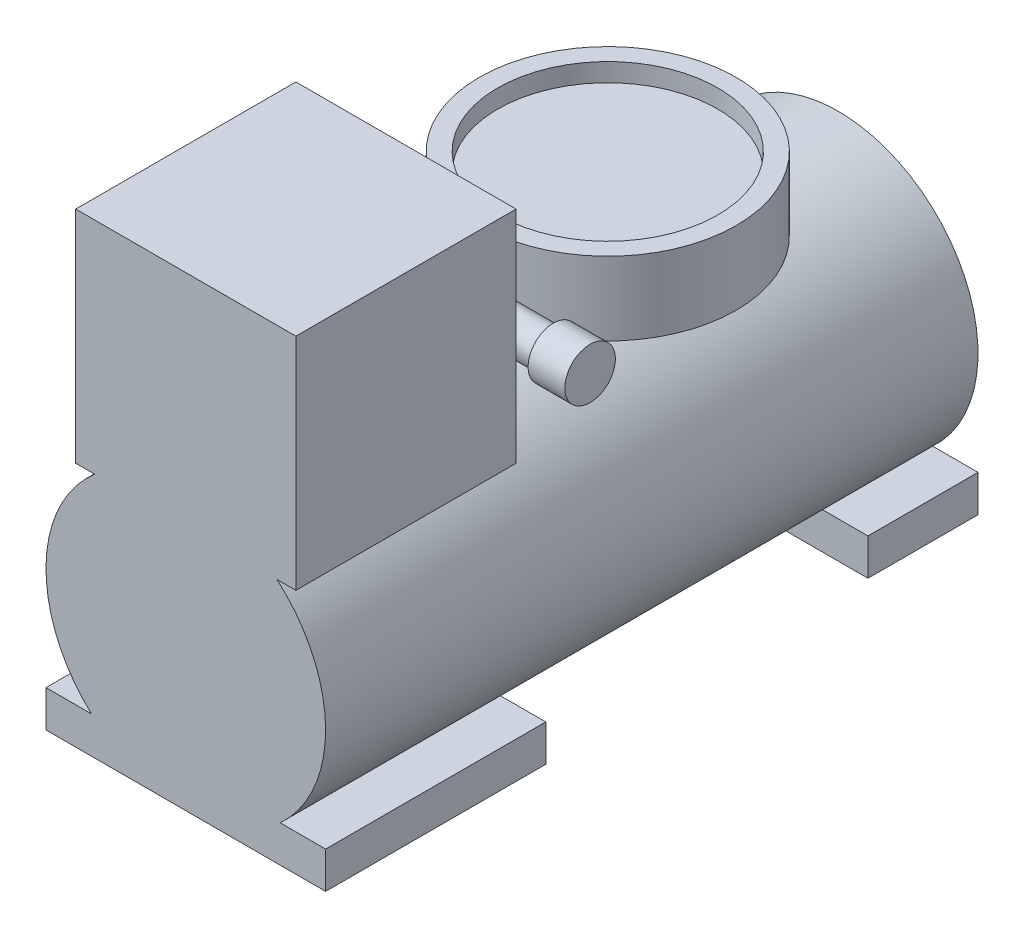
ISO-10303-21;
HEADER;
FILE_DESCRIPTION(('STEP AP214'),'2;1');
FILE_NAME('part.step','',(''),(''),'','','');
FILE_SCHEMA(('AUTOMOTIVE_DESIGN { 1 0 10303 214 1 1 1 1 }'));
ENDSEC;
DATA;
#1=APPLICATION_CONTEXT('core data for automotive mechanical design processes');
#2=APPLICATION_PROTOCOL_DEFINITION('international standard','automotive_design',2000,#1);
#3=PRODUCT_CONTEXT('',#1,'mechanical');
#4=PRODUCT('Part','Part','',(#3));
#5=PRODUCT_RELATED_PRODUCT_CATEGORY('part','',(#4));
#6=PRODUCT_DEFINITION_FORMATION('','',#4);
#7=PRODUCT_DEFINITION_CONTEXT('part definition',#1,'design');
#8=PRODUCT_DEFINITION('design','',#6,#7);
#9=PRODUCT_DEFINITION_SHAPE('','',#8);
#10=(LENGTH_UNIT() NAMED_UNIT(*) SI_UNIT(.MILLI.,.METRE.));
#11=(NAMED_UNIT(*) PLANE_ANGLE_UNIT() SI_UNIT($,.RADIAN.));
#12=(NAMED_UNIT(*) SI_UNIT($,.STERADIAN.) SOLID_ANGLE_UNIT());
#13=UNCERTAINTY_MEASURE_WITH_UNIT(LENGTH_MEASURE(1.E-05),#10,'distance_accuracy_value','');
#14=(GEOMETRIC_REPRESENTATION_CONTEXT(3) GLOBAL_UNCERTAINTY_ASSIGNED_CONTEXT((#13)) GLOBAL_UNIT_ASSIGNED_CONTEXT((#10,
#11,#12)) REPRESENTATION_CONTEXT('',''));
#15=CARTESIAN_POINT('',(0.,0.,0.));
#16=DIRECTION('',(0.,0.,1.));
#17=DIRECTION('',(1.,0.,0.));
#18=AXIS2_PLACEMENT_3D('',#15,#16,#17);
#19=CARTESIAN_POINT('',(40.,50.,107.620508075689));
#20=DIRECTION('',(-1.,0.,0.));
#21=DIRECTION('',(0.,0.,1.));
#22=AXIS2_PLACEMENT_3D('',#19,#20,#21);
#23=CYLINDRICAL_SURFACE('',#22,5.);
#24=CARTESIAN_POINT('',(0.,50.,107.620508075689));
#25=DIRECTION('',(0.707106781186547,0.,0.707106781186547));
#26=DIRECTION('',(-0.707106781186547,0.,0.707106781186547));
#27=AXIS2_PLACEMENT_3D('',#24,#25,#26);
#28=ELLIPSE('',#27,7.07106781186548,5.);
#29=CARTESIAN_POINT('',(0.,45.,107.620508075689));
#30=VERTEX_POINT('',#29);
#31=CARTESIAN_POINT('',(0.,55.,107.620508075689));
#32=VERTEX_POINT('',#31);
#33=EDGE_CURVE('E88',#30,#32,#28,.T.);
#34=ORIENTED_EDGE('',*,*,#33,.T.);
#35=CARTESIAN_POINT('',(0.,50.,107.620508075689));
#36=DIRECTION('',(-0.707106781186547,0.,0.707106781186547));
#37=DIRECTION('',(0.707106781186547,0.,0.707106781186547));
#38=AXIS2_PLACEMENT_3D('',#35,#36,#37);
#39=ELLIPSE('',#38,7.07106781186548,5.);
#40=EDGE_CURVE('E82',#32,#30,#39,.F.);
#41=ORIENTED_EDGE('',*,*,#40,.T.);
#42=EDGE_LOOP('',(#34,#41));
#43=FACE_BOUND('',#42,.T.);
#44=CARTESIAN_POINT('',(30.,50.,107.620508075689));
#45=DIRECTION('',(1.,0.,0.));
#46=DIRECTION('',(0.,0.,-1.));
#47=AXIS2_PLACEMENT_3D('',#44,#45,#46);
#48=CIRCLE('',#47,5.);
#49=CARTESIAN_POINT('',(30.,50.,102.620508075689));
#50=VERTEX_POINT('',#49);
#51=EDGE_CURVE('E14',#50,#50,#48,.T.);
#52=ORIENTED_EDGE('',*,*,#51,.F.);
#53=EDGE_LOOP('',(#52));
#54=FACE_BOUND('',#53,.T.);
#55=ADVANCED_FACE('F73',(#43,#54),#23,.T.);
#56=CARTESIAN_POINT('',(0.,50.,97.8));
#57=DIRECTION('',(0.,0.,1.));
#58=DIRECTION('',(1.,0.,0.));
#59=AXIS2_PLACEMENT_3D('',#56,#57,#58);
#60=CYLINDRICAL_SURFACE('',#59,5.);
#61=CARTESIAN_POINT('',(0.,50.,117.8));
#62=DIRECTION('',(0.,0.,-1.));
#63=DIRECTION('',(-1.,0.,0.));
#64=AXIS2_PLACEMENT_3D('',#61,#62,#63);
#65=CIRCLE('',#64,5.);
#66=CARTESIAN_POINT('',(-5.,50.,117.8));
#67=VERTEX_POINT('',#66);
#68=EDGE_CURVE('E365',#67,#67,#65,.T.);
#69=ORIENTED_EDGE('',*,*,#68,.T.);
#70=EDGE_LOOP('',(#69));
#71=FACE_BOUND('',#70,.T.);
#72=CARTESIAN_POINT('',(0.,50.,97.8));
#73=DIRECTION('',(0.,0.,-1.));
#74=DIRECTION('',(-1.,0.,0.));
#75=AXIS2_PLACEMENT_3D('',#72,#73,#74);
#76=CIRCLE('',#75,5.);
#77=CARTESIAN_POINT('',(-5.,50.,97.8));
#78=VERTEX_POINT('',#77);
#79=CARTESIAN_POINT('',(5.00000000000003,50.,97.8));
#80=VERTEX_POINT('',#79);
#81=EDGE_CURVE('E352',#78,#80,#76,.T.);
#82=ORIENTED_EDGE('',*,*,#81,.F.);
#83=EDGE_CURVE('E368',#80,#78,#76,.T.);
#84=ORIENTED_EDGE('',*,*,#83,.F.);
#85=EDGE_LOOP('',(#82,#84));
#86=FACE_BOUND('',#85,.T.);
#87=ORIENTED_EDGE('',*,*,#40,.F.);
#88=ORIENTED_EDGE('',*,*,#33,.F.);
#89=EDGE_LOOP('',(#87,#88));
#90=FACE_BOUND('',#89,.T.);
#91=ADVANCED_FACE('F252',(#71,#86,#90),#60,.T.);
#92=CARTESIAN_POINT('',(0.,0.,177.8));
#93=DIRECTION('',(0.,0.,-1.));
#94=DIRECTION('',(-1.,0.,0.));
#95=AXIS2_PLACEMENT_3D('',#92,#93,#94);
#96=CYLINDRICAL_SURFACE('',#95,38.1);
#97=CARTESIAN_POINT('',(0.,0.,0.));
#98=DIRECTION('',(0.,0.,1.));
#99=DIRECTION('',(1.,0.,0.));
#100=AXIS2_PLACEMENT_3D('',#97,#98,#99);
#101=CIRCLE('',#100,38.1);
#102=CARTESIAN_POINT('',(25.7293606605372,-28.1,0.));
#103=VERTEX_POINT('',#102);
#104=CARTESIAN_POINT('',(-25.7293606605372,-28.1,0.));
#105=VERTEX_POINT('',#104);
#106=EDGE_CURVE('E277',#103,#105,#101,.T.);
#107=ORIENTED_EDGE('',*,*,#106,.T.);
#108=DIRECTION('',(0.,0.,-1.));
#109=VECTOR('',#108,1.);
#110=CARTESIAN_POINT('',(-25.7293606605372,-28.1,30.));
#111=LINE('',#110,#109);
#112=CARTESIAN_POINT('',(-25.7293606605372,-28.1,30.));
#113=VERTEX_POINT('',#112);
#114=EDGE_CURVE('E890',#113,#105,#111,.T.);
#115=ORIENTED_EDGE('',*,*,#114,.F.);
#116=CARTESIAN_POINT('',(0.,0.,30.));
#117=DIRECTION('',(0.,0.,-1.));
#118=DIRECTION('',(-1.,0.,0.));
#119=AXIS2_PLACEMENT_3D('',#116,#117,#118);
#120=CIRCLE('',#119,38.1);
#121=CARTESIAN_POINT('',(0.,-38.1,30.));
#122=VERTEX_POINT('',#121);
#123=EDGE_CURVE('E888',#122,#113,#120,.T.);
#124=ORIENTED_EDGE('',*,*,#123,.F.);
#125=CARTESIAN_POINT('',(0.,0.,30.));
#126=DIRECTION('',(0.,0.,-1.));
#127=DIRECTION('',(-1.,0.,0.));
#128=AXIS2_PLACEMENT_3D('',#125,#126,#127);
#129=CIRCLE('',#128,38.1);
#130=CARTESIAN_POINT('',(25.7293606605372,-28.1,30.));
#131=VERTEX_POINT('',#130);
#132=EDGE_CURVE('E96',#131,#122,#129,.T.);
#133=ORIENTED_EDGE('',*,*,#132,.F.);
#134=DIRECTION('',(0.,0.,-1.));
#135=VECTOR('',#134,1.);
#136=CARTESIAN_POINT('',(25.7293606605372,-28.1,30.));
#137=LINE('',#136,#135);
#138=EDGE_CURVE('E924',#131,#103,#137,.T.);
#139=ORIENTED_EDGE('',*,*,#138,.T.);
#140=EDGE_LOOP('',(#107,#115,#124,#133,#139));
#141=FACE_BOUND('',#140,.T.);
#142=CARTESIAN_POINT('',(0.,0.,177.8));
#143=DIRECTION('',(0.,0.,1.));
#144=DIRECTION('',(1.,0.,0.));
#145=AXIS2_PLACEMENT_3D('',#142,#143,#144);
#146=CIRCLE('',#145,38.1);
#147=CARTESIAN_POINT('',(25.7293606605372,-28.1,177.8));
#148=VERTEX_POINT('',#147);
#149=CARTESIAN_POINT('',(24.8274042138924,28.9,177.8));
#150=VERTEX_POINT('',#149);
#151=EDGE_CURVE('E280',#148,#150,#146,.T.);
#152=ORIENTED_EDGE('',*,*,#151,.F.);
#153=DIRECTION('',(0.,0.,-1.));
#154=VECTOR('',#153,1.);
#155=CARTESIAN_POINT('',(25.7293606605372,-28.1,177.8));
#156=LINE('',#155,#154);
#157=CARTESIAN_POINT('',(25.7293606605372,-28.1,117.8));
#158=VERTEX_POINT('',#157);
#159=EDGE_CURVE('E312',#148,#158,#156,.T.);
#160=ORIENTED_EDGE('',*,*,#159,.T.);
#161=CARTESIAN_POINT('',(0.,0.,117.8));
#162=DIRECTION('',(0.,0.,1.));
#163=DIRECTION('',(1.,0.,0.));
#164=AXIS2_PLACEMENT_3D('',#161,#162,#163);
#165=CIRCLE('',#164,38.1);
#166=CARTESIAN_POINT('',(0.,-38.1,117.8));
#167=VERTEX_POINT('',#166);
#168=EDGE_CURVE('E271',#167,#158,#165,.T.);
#169=ORIENTED_EDGE('',*,*,#168,.F.);
#170=CARTESIAN_POINT('',(-25.7293606605372,-28.1,117.8));
#171=VERTEX_POINT('',#170);
#172=EDGE_CURVE('E270',#171,#167,#165,.T.);
#173=ORIENTED_EDGE('',*,*,#172,.F.);
#174=DIRECTION('',(0.,0.,-1.));
#175=VECTOR('',#174,1.);
#176=CARTESIAN_POINT('',(-25.7293606605372,-28.1,177.8));
#177=LINE('',#176,#175);
#178=CARTESIAN_POINT('',(-25.7293606605372,-28.1,177.8));
#179=VERTEX_POINT('',#178);
#180=EDGE_CURVE('E326',#171,#179,#177,.F.);
#181=ORIENTED_EDGE('',*,*,#180,.T.);
#182=CARTESIAN_POINT('',(-24.8274042138924,28.9,177.8));
#183=VERTEX_POINT('',#182);
#184=EDGE_CURVE('E276',#183,#179,#146,.T.);
#185=ORIENTED_EDGE('',*,*,#184,.F.);
#186=DIRECTION('',(0.,0.,-1.));
#187=VECTOR('',#186,1.);
#188=CARTESIAN_POINT('',(-24.8274042138924,28.9,177.8));
#189=LINE('',#188,#187);
#190=CARTESIAN_POINT('',(-24.8274042138924,28.9,117.8));
#191=VERTEX_POINT('',#190);
#192=EDGE_CURVE('E281',#183,#191,#189,.T.);
#193=ORIENTED_EDGE('',*,*,#192,.T.);
#194=CARTESIAN_POINT('',(0.,0.,117.8));
#195=DIRECTION('',(0.,0.,-1.));
#196=DIRECTION('',(-1.,0.,0.));
#197=AXIS2_PLACEMENT_3D('',#194,#195,#196);
#198=CIRCLE('',#197,38.1);
#199=CARTESIAN_POINT('',(24.8274042138924,28.9,117.8));
#200=VERTEX_POINT('',#199);
#201=EDGE_CURVE('E273',#191,#200,#198,.T.);
#202=ORIENTED_EDGE('',*,*,#201,.T.);
#203=DIRECTION('',(0.,0.,-1.));
#204=VECTOR('',#203,1.);
#205=CARTESIAN_POINT('',(24.8274042138924,28.9,177.8));
#206=LINE('',#205,#204);
#207=EDGE_CURVE('E286',#200,#150,#206,.F.);
#208=ORIENTED_EDGE('',*,*,#207,.T.);
#209=EDGE_LOOP('',(#152,#160,#169,#173,#181,#185,#193,#202,#208));
#210=FACE_BOUND('',#209,.T.);
#211=DIRECTION('',(0.,0.,-1.));
#212=VECTOR('',#211,1.);
#213=CARTESIAN_POINT('',(2.75862284482696,38.,177.8));
#214=LINE('',#213,#212);
#215=CARTESIAN_POINT('',(2.75862284482696,38.,27.9088836521386));
#216=VERTEX_POINT('',#215);
#217=CARTESIAN_POINT('',(2.75862284482696,38.,19.4226500356341));
#218=VERTEX_POINT('',#217);
#219=EDGE_CURVE('E255',#216,#218,#214,.T.);
#220=ORIENTED_EDGE('',*,*,#219,.F.);
#221=CARTESIAN_POINT('',(2.75862284482696,38.,27.9088836521386));
#222=CARTESIAN_POINT('',(2.29995406358398,38.0333182537512,27.8725988734871));
#223=CARTESIAN_POINT('',(1.8399637283857,38.0583421739678,27.8453519247581));
#224=CARTESIAN_POINT('',(0.919979751665722,38.091659244289,27.8090784101043));
#225=CARTESIAN_POINT('',(0.459989875832862,38.1,27.8));
#226=CARTESIAN_POINT('',(-0.45998987583286,38.1,27.8));
#227=CARTESIAN_POINT('',(-0.91997975166572,38.091659244289,27.8090784101043));
#228=CARTESIAN_POINT('',(-1.8399637283857,38.0583421739678,27.8453519247581));
#229=CARTESIAN_POINT('',(-2.29995406358398,38.0333182537512,27.8725988734871));
#230=CARTESIAN_POINT('',(-2.75862284482696,38.,27.9088836521386));
#231=B_SPLINE_CURVE_WITH_KNOTS('',3,(#221,#222,#223,#224,#225,#226,#227,#228,#229,#230),
.UNSPECIFIED.,.F.,.F.,(4,2,2,2,4),(0.,1.38376181539044,2.76356938468601,4.14337695398159,
5.52713876937202),.UNSPECIFIED.);
#232=CARTESIAN_POINT('',(-2.75862284482696,38.,27.9088836521386));
#233=VERTEX_POINT('',#232);
#234=EDGE_CURVE('E377',#216,#233,#231,.T.);
#235=ORIENTED_EDGE('',*,*,#234,.T.);
#236=DIRECTION('',(0.,0.,-1.));
#237=VECTOR('',#236,1.);
#238=CARTESIAN_POINT('',(-2.75862284482696,38.,177.8));
#239=LINE('',#238,#237);
#240=CARTESIAN_POINT('',(-2.75862284482696,38.,19.4226500356341));
#241=VERTEX_POINT('',#240);
#242=EDGE_CURVE('E262',#241,#233,#239,.F.);
#243=ORIENTED_EDGE('',*,*,#242,.F.);
#244=CARTESIAN_POINT('',(0.,0.,19.4226500356341));
#245=DIRECTION('',(0.,0.,-1.));
#246=DIRECTION('',(-1.,0.,0.));
#247=AXIS2_PLACEMENT_3D('',#244,#245,#246);
#248=CIRCLE('',#247,38.1);
#249=EDGE_CURVE('E257',#241,#218,#248,.T.);
#250=ORIENTED_EDGE('',*,*,#249,.T.);
#251=EDGE_LOOP('',(#220,#235,#243,#250));
#252=FACE_BOUND('',#251,.T.);
#253=ADVANCED_FACE('F75',(#141,#210,#252),#96,.T.);
#254=CARTESIAN_POINT('',(0.,0.,97.8));
#255=DIRECTION('',(0.,0.,1.));
#256=DIRECTION('',(1.,0.,0.));
#257=AXIS2_PLACEMENT_3D('',#254,#255,#256);
#258=PLANE('',#257);
#259=DIRECTION('',(0.,-1.,0.));
#260=VECTOR('',#259,1.);
#261=CARTESIAN_POINT('',(5.00000000000003,0.,97.8));
#262=LINE('',#261,#260);
#263=CARTESIAN_POINT('',(5.00000000000003,60.,97.8));
#264=VERTEX_POINT('',#263);
#265=EDGE_CURVE('E264',#264,#80,#262,.T.);
#266=ORIENTED_EDGE('',*,*,#265,.F.);
#267=DIRECTION('',(1.,0.,0.));
#268=VECTOR('',#267,1.);
#269=CARTESIAN_POINT('',(35.,60.,97.8));
#270=LINE('',#269,#268);
#271=CARTESIAN_POINT('',(-5.,60.,97.8));
#272=VERTEX_POINT('',#271);
#273=EDGE_CURVE('E374',#272,#264,#270,.T.);
#274=ORIENTED_EDGE('',*,*,#273,.F.);
#275=DIRECTION('',(0.,1.,0.));
#276=VECTOR('',#275,1.);
#277=CARTESIAN_POINT('',(-5.,0.,97.8));
#278=LINE('',#277,#276);
#279=EDGE_CURVE('E268',#78,#272,#278,.T.);
#280=ORIENTED_EDGE('',*,*,#279,.F.);
#281=ORIENTED_EDGE('',*,*,#81,.T.);
#282=EDGE_LOOP('',(#266,#274,#280,#281));
#283=FACE_BOUND('',#282,.T.);
#284=ADVANCED_FACE('F406',(#283),#258,.T.);
#285=CARTESIAN_POINT('',(0.,0.,177.8));
#286=DIRECTION('',(0.,0.,1.));
#287=DIRECTION('',(1.,0.,0.));
#288=AXIS2_PLACEMENT_3D('',#285,#286,#287);
#289=PLANE('',#288);
#290=ORIENTED_EDGE('',*,*,#184,.T.);
#291=DIRECTION('',(-1.,0.,0.));
#292=VECTOR('',#291,1.);
#293=CARTESIAN_POINT('',(-38.1,-28.1,177.8));
#294=LINE('',#293,#292);
#295=CARTESIAN_POINT('',(-38.1,-28.1,177.8));
#296=VERTEX_POINT('',#295);
#297=EDGE_CURVE('E343',#179,#296,#294,.T.);
#298=ORIENTED_EDGE('',*,*,#297,.T.);
#299=DIRECTION('',(0.,-1.,0.));
#300=VECTOR('',#299,1.);
#301=CARTESIAN_POINT('',(-38.1,-28.1,177.8));
#302=LINE('',#301,#300);
#303=CARTESIAN_POINT('',(-38.1,-38.1,177.8));
#304=VERTEX_POINT('',#303);
#305=EDGE_CURVE('E349',#296,#304,#302,.T.);
#306=ORIENTED_EDGE('',*,*,#305,.T.);
#307=DIRECTION('',(1.,0.,0.));
#308=VECTOR('',#307,1.);
#309=CARTESIAN_POINT('',(-38.1,-38.1,177.8));
#310=LINE('',#309,#308);
#311=CARTESIAN_POINT('',(38.1,-38.1,177.8));
#312=VERTEX_POINT('',#311);
#313=EDGE_CURVE('E347',#304,#312,#310,.T.);
#314=ORIENTED_EDGE('',*,*,#313,.T.);
#315=DIRECTION('',(0.,1.,0.));
#316=VECTOR('',#315,1.);
#317=CARTESIAN_POINT('',(38.1,-28.1,177.8));
#318=LINE('',#317,#316);
#319=CARTESIAN_POINT('',(38.1,-28.1,177.8));
#320=VERTEX_POINT('',#319);
#321=EDGE_CURVE('E344',#312,#320,#318,.T.);
#322=ORIENTED_EDGE('',*,*,#321,.T.);
#323=EDGE_CURVE('E340',#320,#148,#294,.T.);
#324=ORIENTED_EDGE('',*,*,#323,.T.);
#325=ORIENTED_EDGE('',*,*,#151,.T.);
#326=DIRECTION('',(1.,0.,0.));
#327=VECTOR('',#326,1.);
#328=CARTESIAN_POINT('',(-30.,28.9,177.8));
#329=LINE('',#328,#327);
#330=CARTESIAN_POINT('',(30.,28.9,177.8));
#331=VERTEX_POINT('',#330);
#332=EDGE_CURVE('E302',#150,#331,#329,.T.);
#333=ORIENTED_EDGE('',*,*,#332,.T.);
#334=DIRECTION('',(0.,1.,0.));
#335=VECTOR('',#334,1.);
#336=CARTESIAN_POINT('',(30.,28.9,177.8));
#337=LINE('',#336,#335);
#338=CARTESIAN_POINT('',(30.,88.9,177.8));
#339=VERTEX_POINT('',#338);
#340=EDGE_CURVE('E309',#331,#339,#337,.T.);
#341=ORIENTED_EDGE('',*,*,#340,.T.);
#342=DIRECTION('',(-1.,0.,0.));
#343=VECTOR('',#342,1.);
#344=CARTESIAN_POINT('',(-30.,88.9,177.8));
#345=LINE('',#344,#343);
#346=CARTESIAN_POINT('',(-30.,88.9,177.8));
#347=VERTEX_POINT('',#346);
#348=EDGE_CURVE('E306',#339,#347,#345,.T.);
#349=ORIENTED_EDGE('',*,*,#348,.T.);
#350=DIRECTION('',(0.,-1.,0.));
#351=VECTOR('',#350,1.);
#352=CARTESIAN_POINT('',(-30.,28.9,177.8));
#353=LINE('',#352,#351);
#354=CARTESIAN_POINT('',(-30.,28.9,177.8));
#355=VERTEX_POINT('',#354);
#356=EDGE_CURVE('E303',#347,#355,#353,.T.);
#357=ORIENTED_EDGE('',*,*,#356,.T.);
#358=EDGE_CURVE('E299',#355,#183,#329,.T.);
#359=ORIENTED_EDGE('',*,*,#358,.T.);
#360=EDGE_LOOP('',(#290,#298,#306,#314,#322,#324,#325,#333,#341,#349,#357,#359));
#361=FACE_BOUND('',#360,.T.);
#362=ADVANCED_FACE('F461',(#361),#289,.T.);
#363=CARTESIAN_POINT('',(0.,0.,0.));
#364=DIRECTION('',(0.,0.,1.));
#365=DIRECTION('',(1.,0.,0.));
#366=AXIS2_PLACEMENT_3D('',#363,#364,#365);
#367=PLANE('',#366);
#368=ORIENTED_EDGE('',*,*,#106,.F.);
#369=DIRECTION('',(1.,0.,0.));
#370=VECTOR('',#369,1.);
#371=CARTESIAN_POINT('',(0.,-28.1,0.));
#372=LINE('',#371,#370);
#373=CARTESIAN_POINT('',(38.1,-28.1,0.));
#374=VERTEX_POINT('',#373);
#375=EDGE_CURVE('E895',#103,#374,#372,.T.);
#376=ORIENTED_EDGE('',*,*,#375,.T.);
#377=DIRECTION('',(0.,-1.,0.));
#378=VECTOR('',#377,1.);
#379=CARTESIAN_POINT('',(38.1,0.,0.));
#380=LINE('',#379,#378);
#381=CARTESIAN_POINT('',(38.1,-38.1,0.));
#382=VERTEX_POINT('',#381);
#383=EDGE_CURVE('E920',#374,#382,#380,.T.);
#384=ORIENTED_EDGE('',*,*,#383,.T.);
#385=DIRECTION('',(-1.,0.,0.));
#386=VECTOR('',#385,1.);
#387=CARTESIAN_POINT('',(0.,-38.1,0.));
#388=LINE('',#387,#386);
#389=CARTESIAN_POINT('',(-38.1,-38.1,0.));
#390=VERTEX_POINT('',#389);
#391=EDGE_CURVE('E910',#382,#390,#388,.T.);
#392=ORIENTED_EDGE('',*,*,#391,.T.);
#393=DIRECTION('',(0.,1.,0.));
#394=VECTOR('',#393,1.);
#395=CARTESIAN_POINT('',(-38.1,0.,0.));
#396=LINE('',#395,#394);
#397=CARTESIAN_POINT('',(-38.1,-28.1,0.));
#398=VERTEX_POINT('',#397);
#399=EDGE_CURVE('E896',#390,#398,#396,.T.);
#400=ORIENTED_EDGE('',*,*,#399,.T.);
#401=DIRECTION('',(1.,0.,0.));
#402=VECTOR('',#401,1.);
#403=CARTESIAN_POINT('',(0.,-28.1,0.));
#404=LINE('',#403,#402);
#405=EDGE_CURVE('E892',#398,#105,#404,.T.);
#406=ORIENTED_EDGE('',*,*,#405,.T.);
#407=EDGE_LOOP('',(#368,#376,#384,#392,#400,#406));
#408=FACE_BOUND('',#407,.T.);
#409=ADVANCED_FACE('F448',(#408),#367,.F.);
#410=CARTESIAN_POINT('',(-30.,28.9,117.8));
#411=DIRECTION('',(0.,-1.,0.));
#412=DIRECTION('',(0.,0.,-1.));
#413=AXIS2_PLACEMENT_3D('',#410,#411,#412);
#414=PLANE('',#413);
#415=ORIENTED_EDGE('',*,*,#192,.F.);
#416=ORIENTED_EDGE('',*,*,#358,.F.);
#417=DIRECTION('',(0.,0.,1.));
#418=VECTOR('',#417,1.);
#419=CARTESIAN_POINT('',(-30.,28.9,117.8));
#420=LINE('',#419,#418);
#421=CARTESIAN_POINT('',(-30.,28.9,117.8));
#422=VERTEX_POINT('',#421);
#423=EDGE_CURVE('E295',#422,#355,#420,.T.);
#424=ORIENTED_EDGE('',*,*,#423,.F.);
#425=DIRECTION('',(1.,0.,0.));
#426=VECTOR('',#425,1.);
#427=CARTESIAN_POINT('',(-30.,28.9,117.8));
#428=LINE('',#427,#426);
#429=EDGE_CURVE('E293',#422,#191,#428,.T.);
#430=ORIENTED_EDGE('',*,*,#429,.T.);
#431=EDGE_LOOP('',(#415,#416,#424,#430));
#432=FACE_BOUND('',#431,.T.);
#433=ADVANCED_FACE('F444',(#432),#414,.T.);
#434=ORIENTED_EDGE('',*,*,#207,.F.);
#435=CARTESIAN_POINT('',(30.,28.9,117.8));
#436=VERTEX_POINT('',#435);
#437=EDGE_CURVE('E315',#200,#436,#428,.T.);
#438=ORIENTED_EDGE('',*,*,#437,.T.);
#439=DIRECTION('',(0.,0.,1.));
#440=VECTOR('',#439,1.);
#441=CARTESIAN_POINT('',(30.,28.9,117.8));
#442=LINE('',#441,#440);
#443=EDGE_CURVE('E289',#436,#331,#442,.T.);
#444=ORIENTED_EDGE('',*,*,#443,.T.);
#445=ORIENTED_EDGE('',*,*,#332,.F.);
#446=EDGE_LOOP('',(#434,#438,#444,#445));
#447=FACE_BOUND('',#446,.T.);
#448=ADVANCED_FACE('F447',(#447),#414,.T.);
#449=CARTESIAN_POINT('',(30.,28.9,117.8));
#450=DIRECTION('',(1.,0.,0.));
#451=DIRECTION('',(0.,0.,-1.));
#452=AXIS2_PLACEMENT_3D('',#449,#450,#451);
#453=PLANE('',#452);
#454=ORIENTED_EDGE('',*,*,#340,.F.);
#455=ORIENTED_EDGE('',*,*,#443,.F.);
#456=DIRECTION('',(0.,1.,0.));
#457=VECTOR('',#456,1.);
#458=CARTESIAN_POINT('',(30.,28.9,117.8));
#459=LINE('',#458,#457);
#460=CARTESIAN_POINT('',(30.,88.9,117.8));
#461=VERTEX_POINT('',#460);
#462=EDGE_CURVE('E301',#436,#461,#459,.T.);
#463=ORIENTED_EDGE('',*,*,#462,.T.);
#464=DIRECTION('',(0.,0.,1.));
#465=VECTOR('',#464,1.);
#466=CARTESIAN_POINT('',(30.,88.9,117.8));
#467=LINE('',#466,#465);
#468=EDGE_CURVE('E290',#461,#339,#467,.T.);
#469=ORIENTED_EDGE('',*,*,#468,.T.);
#470=EDGE_LOOP('',(#454,#455,#463,#469));
#471=FACE_BOUND('',#470,.T.);
#472=ADVANCED_FACE('F453',(#471),#453,.T.);
#473=CARTESIAN_POINT('',(-30.,28.9,117.8));
#474=DIRECTION('',(-1.,0.,0.));
#475=DIRECTION('',(0.,0.,1.));
#476=AXIS2_PLACEMENT_3D('',#473,#474,#475);
#477=PLANE('',#476);
#478=ORIENTED_EDGE('',*,*,#356,.F.);
#479=DIRECTION('',(0.,0.,1.));
#480=VECTOR('',#479,1.);
#481=CARTESIAN_POINT('',(-30.,88.9,117.8));
#482=LINE('',#481,#480);
#483=CARTESIAN_POINT('',(-30.,88.9,117.8));
#484=VERTEX_POINT('',#483);
#485=EDGE_CURVE('E292',#484,#347,#482,.T.);
#486=ORIENTED_EDGE('',*,*,#485,.F.);
#487=DIRECTION('',(0.,-1.,0.));
#488=VECTOR('',#487,1.);
#489=CARTESIAN_POINT('',(-30.,28.9,117.8));
#490=LINE('',#489,#488);
#491=EDGE_CURVE('E316',#484,#422,#490,.T.);
#492=ORIENTED_EDGE('',*,*,#491,.T.);
#493=ORIENTED_EDGE('',*,*,#423,.T.);
#494=EDGE_LOOP('',(#478,#486,#492,#493));
#495=FACE_BOUND('',#494,.T.);
#496=ADVANCED_FACE('F450',(#495),#477,.T.);
#497=CARTESIAN_POINT('',(-30.,88.9,117.8));
#498=DIRECTION('',(0.,1.,0.));
#499=DIRECTION('',(0.,0.,1.));
#500=AXIS2_PLACEMENT_3D('',#497,#498,#499);
#501=PLANE('',#500);
#502=ORIENTED_EDGE('',*,*,#348,.F.);
#503=ORIENTED_EDGE('',*,*,#468,.F.);
#504=DIRECTION('',(-1.,0.,0.));
#505=VECTOR('',#504,1.);
#506=CARTESIAN_POINT('',(-30.,88.9,117.8));
#507=LINE('',#506,#505);
#508=EDGE_CURVE('E319',#461,#484,#507,.T.);
#509=ORIENTED_EDGE('',*,*,#508,.T.);
#510=ORIENTED_EDGE('',*,*,#485,.T.);
#511=EDGE_LOOP('',(#502,#503,#509,#510));
#512=FACE_BOUND('',#511,.T.);
#513=ADVANCED_FACE('F442',(#512),#501,.T.);
#514=CARTESIAN_POINT('',(0.,0.,117.8));
#515=DIRECTION('',(0.,0.,-1.));
#516=DIRECTION('',(-1.,0.,0.));
#517=AXIS2_PLACEMENT_3D('',#514,#515,#516);
#518=PLANE('',#517);
#519=ORIENTED_EDGE('',*,*,#68,.F.);
#520=EDGE_LOOP('',(#519));
#521=FACE_BOUND('',#520,.T.);
#522=ORIENTED_EDGE('',*,*,#201,.F.);
#523=ORIENTED_EDGE('',*,*,#429,.F.);
#524=ORIENTED_EDGE('',*,*,#491,.F.);
#525=ORIENTED_EDGE('',*,*,#508,.F.);
#526=ORIENTED_EDGE('',*,*,#462,.F.);
#527=ORIENTED_EDGE('',*,*,#437,.F.);
#528=EDGE_LOOP('',(#522,#523,#524,#525,#526,#527));
#529=FACE_BOUND('',#528,.T.);
#530=ADVANCED_FACE('F439',(#521,#529),#518,.T.);
#531=CARTESIAN_POINT('',(0.,0.,117.8));
#532=DIRECTION('',(0.,0.,1.));
#533=DIRECTION('',(1.,0.,0.));
#534=AXIS2_PLACEMENT_3D('',#531,#532,#533);
#535=PLANE('',#534);
#536=DIRECTION('',(-1.,0.,0.));
#537=VECTOR('',#536,1.);
#538=CARTESIAN_POINT('',(-38.1,-28.1,117.8));
#539=LINE('',#538,#537);
#540=CARTESIAN_POINT('',(-38.1,-28.1,117.8));
#541=VERTEX_POINT('',#540);
#542=EDGE_CURVE('E355',#171,#541,#539,.T.);
#543=ORIENTED_EDGE('',*,*,#542,.F.);
#544=ORIENTED_EDGE('',*,*,#172,.T.);
#545=DIRECTION('',(1.,0.,0.));
#546=VECTOR('',#545,1.);
#547=CARTESIAN_POINT('',(-38.1,-38.1,117.8));
#548=LINE('',#547,#546);
#549=CARTESIAN_POINT('',(-38.1,-38.1,117.8));
#550=VERTEX_POINT('',#549);
#551=EDGE_CURVE('E359',#550,#167,#548,.T.);
#552=ORIENTED_EDGE('',*,*,#551,.F.);
#553=DIRECTION('',(0.,-1.,0.));
#554=VECTOR('',#553,1.);
#555=CARTESIAN_POINT('',(-38.1,-28.1,117.8));
#556=LINE('',#555,#554);
#557=EDGE_CURVE('E342',#541,#550,#556,.T.);
#558=ORIENTED_EDGE('',*,*,#557,.F.);
#559=EDGE_LOOP('',(#543,#544,#552,#558));
#560=FACE_BOUND('',#559,.T.);
#561=ADVANCED_FACE('F422',(#560),#535,.F.);
#562=CARTESIAN_POINT('',(-38.1,-28.1,117.8));
#563=DIRECTION('',(0.,1.,0.));
#564=DIRECTION('',(-1.,0.,0.));
#565=AXIS2_PLACEMENT_3D('',#562,#563,#564);
#566=PLANE('',#565);
#567=ORIENTED_EDGE('',*,*,#159,.F.);
#568=ORIENTED_EDGE('',*,*,#323,.F.);
#569=DIRECTION('',(0.,0.,1.));
#570=VECTOR('',#569,1.);
#571=CARTESIAN_POINT('',(38.1,-28.1,117.8));
#572=LINE('',#571,#570);
#573=CARTESIAN_POINT('',(38.1,-28.1,117.8));
#574=VERTEX_POINT('',#573);
#575=EDGE_CURVE('E336',#574,#320,#572,.T.);
#576=ORIENTED_EDGE('',*,*,#575,.F.);
#577=EDGE_CURVE('E333',#574,#158,#539,.T.);
#578=ORIENTED_EDGE('',*,*,#577,.T.);
#579=EDGE_LOOP('',(#567,#568,#576,#578));
#580=FACE_BOUND('',#579,.T.);
#581=ADVANCED_FACE('F423',(#580),#566,.T.);
#582=ORIENTED_EDGE('',*,*,#180,.F.);
#583=ORIENTED_EDGE('',*,*,#542,.T.);
#584=DIRECTION('',(0.,0.,1.));
#585=VECTOR('',#584,1.);
#586=CARTESIAN_POINT('',(-38.1,-28.1,117.8));
#587=LINE('',#586,#585);
#588=EDGE_CURVE('E329',#541,#296,#587,.T.);
#589=ORIENTED_EDGE('',*,*,#588,.T.);
#590=ORIENTED_EDGE('',*,*,#297,.F.);
#591=EDGE_LOOP('',(#582,#583,#589,#590));
#592=FACE_BOUND('',#591,.T.);
#593=ADVANCED_FACE('F426',(#592),#566,.T.);
#594=CARTESIAN_POINT('',(-38.1,-38.1,117.8));
#595=DIRECTION('',(0.,-1.,0.));
#596=DIRECTION('',(1.,0.,0.));
#597=AXIS2_PLACEMENT_3D('',#594,#595,#596);
#598=PLANE('',#597);
#599=ORIENTED_EDGE('',*,*,#551,.T.);
#600=CARTESIAN_POINT('',(38.1,-38.1,117.8));
#601=VERTEX_POINT('',#600);
#602=EDGE_CURVE('E362',#167,#601,#548,.T.);
#603=ORIENTED_EDGE('',*,*,#602,.T.);
#604=DIRECTION('',(0.,0.,1.));
#605=VECTOR('',#604,1.);
#606=CARTESIAN_POINT('',(38.1,-38.1,117.8));
#607=LINE('',#606,#605);
#608=EDGE_CURVE('E332',#601,#312,#607,.T.);
#609=ORIENTED_EDGE('',*,*,#608,.T.);
#610=ORIENTED_EDGE('',*,*,#313,.F.);
#611=DIRECTION('',(0.,0.,1.));
#612=VECTOR('',#611,1.);
#613=CARTESIAN_POINT('',(-38.1,-38.1,117.8));
#614=LINE('',#613,#612);
#615=EDGE_CURVE('E330',#550,#304,#614,.T.);
#616=ORIENTED_EDGE('',*,*,#615,.F.);
#617=EDGE_LOOP('',(#599,#603,#609,#610,#616));
#618=FACE_BOUND('',#617,.T.);
#619=ADVANCED_FACE('F432',(#618),#598,.T.);
#620=CARTESIAN_POINT('',(-38.1,-28.1,117.8));
#621=DIRECTION('',(-1.,0.,0.));
#622=DIRECTION('',(0.,0.,1.));
#623=AXIS2_PLACEMENT_3D('',#620,#621,#622);
#624=PLANE('',#623);
#625=ORIENTED_EDGE('',*,*,#305,.F.);
#626=ORIENTED_EDGE('',*,*,#588,.F.);
#627=ORIENTED_EDGE('',*,*,#557,.T.);
#628=ORIENTED_EDGE('',*,*,#615,.T.);
#629=EDGE_LOOP('',(#625,#626,#627,#628));
#630=FACE_BOUND('',#629,.T.);
#631=ADVANCED_FACE('F430',(#630),#624,.T.);
#632=CARTESIAN_POINT('',(38.1,-28.1,117.8));
#633=DIRECTION('',(1.,0.,0.));
#634=DIRECTION('',(0.,1.,0.));
#635=AXIS2_PLACEMENT_3D('',#632,#633,#634);
#636=PLANE('',#635);
#637=ORIENTED_EDGE('',*,*,#321,.F.);
#638=ORIENTED_EDGE('',*,*,#608,.F.);
#639=DIRECTION('',(0.,1.,0.));
#640=VECTOR('',#639,1.);
#641=CARTESIAN_POINT('',(38.1,-28.1,117.8));
#642=LINE('',#641,#640);
#643=EDGE_CURVE('E356',#601,#574,#642,.T.);
#644=ORIENTED_EDGE('',*,*,#643,.T.);
#645=ORIENTED_EDGE('',*,*,#575,.T.);
#646=EDGE_LOOP('',(#637,#638,#644,#645));
#647=FACE_BOUND('',#646,.T.);
#648=ADVANCED_FACE('F420',(#647),#636,.T.);
#649=ORIENTED_EDGE('',*,*,#602,.F.);
#650=ORIENTED_EDGE('',*,*,#168,.T.);
#651=ORIENTED_EDGE('',*,*,#577,.F.);
#652=ORIENTED_EDGE('',*,*,#643,.F.);
#653=EDGE_LOOP('',(#649,#650,#651,#652));
#654=FACE_BOUND('',#653,.T.);
#655=ADVANCED_FACE('F413',(#654),#535,.F.);
#656=CARTESIAN_POINT('',(35.,60.,27.8));
#657=DIRECTION('',(0.,-1.,0.));
#658=DIRECTION('',(0.,0.,-1.));
#659=AXIS2_PLACEMENT_3D('',#656,#657,#658);
#660=PLANE('',#659);
#661=CARTESIAN_POINT('',(0.,60.,62.8));
#662=DIRECTION('',(0.,1.,0.));
#663=DIRECTION('',(0.,0.,1.));
#664=AXIS2_PLACEMENT_3D('',#661,#662,#663);
#665=CIRCLE('',#664,30.);
#666=CARTESIAN_POINT('',(0.,60.,92.8));
#667=VERTEX_POINT('',#666);
#668=EDGE_CURVE('E537',#667,#667,#665,.T.);
#669=ORIENTED_EDGE('',*,*,#668,.F.);
#670=EDGE_LOOP('',(#669));
#671=FACE_BOUND('',#670,.T.);
#672=ORIENTED_EDGE('',*,*,#273,.T.);
#673=DIRECTION('',(0.,0.,1.));
#674=VECTOR('',#673,1.);
#675=CARTESIAN_POINT('',(5.00000000000003,60.,97.4410161513775));
#676=LINE('',#675,#674);
#677=CARTESIAN_POINT('',(5.00000000000003,60.,97.4410161513775));
#678=VERTEX_POINT('',#677);
#679=EDGE_CURVE('E532',#678,#264,#676,.T.);
#680=ORIENTED_EDGE('',*,*,#679,.F.);
#681=CARTESIAN_POINT('',(0.,60.,62.8));
#682=DIRECTION('',(0.,-1.,0.));
#683=DIRECTION('',(0.,0.,1.));
#684=AXIS2_PLACEMENT_3D('',#681,#682,#683);
#685=CIRCLE('',#684,35.);
#686=CARTESIAN_POINT('',(-5.,60.,97.4410161513775));
#687=VERTEX_POINT('',#686);
#688=EDGE_CURVE('E534',#687,#678,#685,.T.);
#689=ORIENTED_EDGE('',*,*,#688,.F.);
#690=DIRECTION('',(0.,0.,-1.));
#691=VECTOR('',#690,1.);
#692=CARTESIAN_POINT('',(-5.,60.,106.177349964366));
#693=LINE('',#692,#691);
#694=EDGE_CURVE('E540',#272,#687,#693,.T.);
#695=ORIENTED_EDGE('',*,*,#694,.F.);
#696=EDGE_LOOP('',(#672,#680,#689,#695));
#697=FACE_BOUND('',#696,.T.);
#698=ADVANCED_FACE('F409',(#671,#697),#660,.F.);
#699=CARTESIAN_POINT('',(35.,40.,27.8));
#700=DIRECTION('',(0.,1.,0.));
#701=DIRECTION('',(0.,0.,1.));
#702=AXIS2_PLACEMENT_3D('',#699,#700,#701);
#703=PLANE('',#702);
#704=CARTESIAN_POINT('',(0.,40.,62.8));
#705=DIRECTION('',(0.,1.,0.));
#706=DIRECTION('',(0.,0.,1.));
#707=AXIS2_PLACEMENT_3D('',#704,#705,#706);
#708=CIRCLE('',#707,35.);
#709=CARTESIAN_POINT('',(-5.,40.,97.4410161513775));
#710=VERTEX_POINT('',#709);
#711=CARTESIAN_POINT('',(5.00000000000003,40.,97.4410161513775));
#712=VERTEX_POINT('',#711);
#713=EDGE_CURVE('E384',#710,#712,#708,.F.);
#714=ORIENTED_EDGE('',*,*,#713,.T.);
#715=DIRECTION('',(0.,0.,1.));
#716=VECTOR('',#715,1.);
#717=CARTESIAN_POINT('',(5.00000000000003,40.,27.8));
#718=LINE('',#717,#716);
#719=CARTESIAN_POINT('',(5.00000000000003,40.,97.8));
#720=VERTEX_POINT('',#719);
#721=EDGE_CURVE('E552',#712,#720,#718,.T.);
#722=ORIENTED_EDGE('',*,*,#721,.T.);
#723=DIRECTION('',(-1.,0.,0.));
#724=VECTOR('',#723,1.);
#725=CARTESIAN_POINT('',(35.,40.,97.8));
#726=LINE('',#725,#724);
#727=CARTESIAN_POINT('',(-5.,40.,97.8));
#728=VERTEX_POINT('',#727);
#729=EDGE_CURVE('E369',#720,#728,#726,.T.);
#730=ORIENTED_EDGE('',*,*,#729,.T.);
#731=DIRECTION('',(0.,0.,-1.));
#732=VECTOR('',#731,1.);
#733=CARTESIAN_POINT('',(-5.,40.,27.8));
#734=LINE('',#733,#732);
#735=EDGE_CURVE('E548',#728,#710,#734,.T.);
#736=ORIENTED_EDGE('',*,*,#735,.T.);
#737=EDGE_LOOP('',(#714,#722,#730,#736));
#738=FACE_BOUND('',#737,.T.);
#739=ADVANCED_FACE('F404',(#738),#703,.F.);
#740=EDGE_CURVE('E265',#80,#720,#262,.T.);
#741=ORIENTED_EDGE('',*,*,#740,.F.);
#742=ORIENTED_EDGE('',*,*,#83,.T.);
#743=EDGE_CURVE('E267',#728,#78,#278,.T.);
#744=ORIENTED_EDGE('',*,*,#743,.F.);
#745=ORIENTED_EDGE('',*,*,#729,.F.);
#746=EDGE_LOOP('',(#741,#742,#744,#745));
#747=FACE_BOUND('',#746,.T.);
#748=ADVANCED_FACE('F400',(#747),#258,.T.);
#749=CARTESIAN_POINT('',(-5.,38.,106.177349964366));
#750=DIRECTION('',(1.,0.,0.));
#751=DIRECTION('',(0.,0.,-1.));
#752=AXIS2_PLACEMENT_3D('',#749,#750,#751);
#753=PLANE('',#752);
#754=ORIENTED_EDGE('',*,*,#743,.T.);
#755=ORIENTED_EDGE('',*,*,#279,.T.);
#756=ORIENTED_EDGE('',*,*,#694,.T.);
#757=DIRECTION('',(0.,1.,0.));
#758=VECTOR('',#757,1.);
#759=CARTESIAN_POINT('',(-5.,38.,97.4410161513775));
#760=LINE('',#759,#758);
#761=EDGE_CURVE('E525',#710,#687,#760,.T.);
#762=ORIENTED_EDGE('',*,*,#761,.F.);
#763=ORIENTED_EDGE('',*,*,#735,.F.);
#764=EDGE_LOOP('',(#754,#755,#756,#762,#763));
#765=FACE_BOUND('',#764,.T.);
#766=ADVANCED_FACE('F397',(#765),#753,.F.);
#767=CARTESIAN_POINT('',(5.00000000000003,38.,97.4410161513775));
#768=DIRECTION('',(-1.,0.,0.));
#769=DIRECTION('',(0.,0.,1.));
#770=AXIS2_PLACEMENT_3D('',#767,#768,#769);
#771=PLANE('',#770);
#772=DIRECTION('',(0.,1.,0.));
#773=VECTOR('',#772,1.);
#774=CARTESIAN_POINT('',(5.00000000000003,38.,97.4410161513775));
#775=LINE('',#774,#773);
#776=EDGE_CURVE('E545',#712,#678,#775,.T.);
#777=ORIENTED_EDGE('',*,*,#776,.T.);
#778=ORIENTED_EDGE('',*,*,#679,.T.);
#779=ORIENTED_EDGE('',*,*,#265,.T.);
#780=ORIENTED_EDGE('',*,*,#740,.T.);
#781=ORIENTED_EDGE('',*,*,#721,.F.);
#782=EDGE_LOOP('',(#777,#778,#779,#780,#781));
#783=FACE_BOUND('',#782,.T.);
#784=ADVANCED_FACE('F395',(#783),#771,.F.);
#785=CARTESIAN_POINT('',(0.,38.,62.8));
#786=DIRECTION('',(0.,1.,0.));
#787=DIRECTION('',(0.,0.,1.));
#788=AXIS2_PLACEMENT_3D('',#785,#786,#787);
#789=CYLINDRICAL_SURFACE('',#788,35.);
#790=ORIENTED_EDGE('',*,*,#761,.T.);
#791=ORIENTED_EDGE('',*,*,#688,.T.);
#792=ORIENTED_EDGE('',*,*,#776,.F.);
#793=ORIENTED_EDGE('',*,*,#713,.F.);
#794=EDGE_LOOP('',(#790,#791,#792,#793));
#795=FACE_BOUND('',#794,.T.);
#796=ADVANCED_FACE('F394',(#795),#789,.T.);
#797=CARTESIAN_POINT('',(48.7419251144212,38.,19.4226500356341));
#798=DIRECTION('',(0.,0.,-1.));
#799=DIRECTION('',(-1.,0.,0.));
#800=AXIS2_PLACEMENT_3D('',#797,#798,#799);
#801=PLANE('',#800);
#802=DIRECTION('',(-1.,0.,0.));
#803=VECTOR('',#802,1.);
#804=CARTESIAN_POINT('',(48.7419251144212,38.,19.4226500356341));
#805=LINE('',#804,#803);
#806=EDGE_CURVE('E523',#218,#241,#805,.T.);
#807=ORIENTED_EDGE('',*,*,#806,.F.);
#808=ORIENTED_EDGE('',*,*,#249,.F.);
#809=EDGE_LOOP('',(#807,#808));
#810=FACE_BOUND('',#809,.T.);
#811=ADVANCED_FACE('F513',(#810),#801,.F.);
#812=CARTESIAN_POINT('',(0.,38.,62.8));
#813=DIRECTION('',(0.,1.,0.));
#814=DIRECTION('',(0.,0.,1.));
#815=AXIS2_PLACEMENT_3D('',#812,#813,#814);
#816=PLANE('',#815);
#817=ORIENTED_EDGE('',*,*,#219,.T.);
#818=ORIENTED_EDGE('',*,*,#806,.T.);
#819=ORIENTED_EDGE('',*,*,#242,.T.);
#820=CARTESIAN_POINT('',(0.,38.,62.8));
#821=DIRECTION('',(0.,-1.,0.));
#822=DIRECTION('',(0.,0.,1.));
#823=AXIS2_PLACEMENT_3D('',#820,#821,#822);
#824=CIRCLE('',#823,35.);
#825=EDGE_CURVE('E526',#233,#216,#824,.T.);
#826=ORIENTED_EDGE('',*,*,#825,.T.);
#827=EDGE_LOOP('',(#817,#818,#819,#826));
#828=FACE_BOUND('',#827,.T.);
#829=ADVANCED_FACE('F392',(#828),#816,.T.);
#830=ORIENTED_EDGE('',*,*,#825,.F.);
#831=ORIENTED_EDGE('',*,*,#234,.F.);
#832=EDGE_LOOP('',(#830,#831));
#833=FACE_BOUND('',#832,.T.);
#834=ADVANCED_FACE('F386',(#833),#789,.T.);
#835=CARTESIAN_POINT('',(0.,55.,62.8));
#836=DIRECTION('',(0.,1.,0.));
#837=DIRECTION('',(0.,0.,1.));
#838=AXIS2_PLACEMENT_3D('',#835,#836,#837);
#839=CYLINDRICAL_SURFACE('',#838,30.);
#840=CARTESIAN_POINT('',(0.,55.,62.8));
#841=DIRECTION('',(0.,1.,0.));
#842=DIRECTION('',(0.,0.,1.));
#843=AXIS2_PLACEMENT_3D('',#840,#841,#842);
#844=CIRCLE('',#843,30.);
#845=CARTESIAN_POINT('',(0.,55.,92.8));
#846=VERTEX_POINT('',#845);
#847=EDGE_CURVE('E543',#846,#846,#844,.T.);
#848=ORIENTED_EDGE('',*,*,#847,.F.);
#849=EDGE_LOOP('',(#848));
#850=FACE_BOUND('',#849,.T.);
#851=ORIENTED_EDGE('',*,*,#668,.T.);
#852=EDGE_LOOP('',(#851));
#853=FACE_BOUND('',#852,.T.);
#854=ADVANCED_FACE('F391',(#850,#853),#839,.F.);
#855=CARTESIAN_POINT('',(0.,55.,62.8));
#856=DIRECTION('',(0.,1.,0.));
#857=DIRECTION('',(0.,0.,1.));
#858=AXIS2_PLACEMENT_3D('',#855,#856,#857);
#859=PLANE('',#858);
#860=ORIENTED_EDGE('',*,*,#847,.T.);
#861=EDGE_LOOP('',(#860));
#862=FACE_BOUND('',#861,.T.);
#863=ADVANCED_FACE('F504',(#862),#859,.T.);
#864=CARTESIAN_POINT('',(0.,-28.1,30.));
#865=DIRECTION('',(0.,1.,0.));
#866=DIRECTION('',(0.,0.,1.));
#867=AXIS2_PLACEMENT_3D('',#864,#865,#866);
#868=PLANE('',#867);
#869=ORIENTED_EDGE('',*,*,#375,.F.);
#870=ORIENTED_EDGE('',*,*,#138,.F.);
#871=DIRECTION('',(1.,0.,0.));
#872=VECTOR('',#871,1.);
#873=CARTESIAN_POINT('',(0.,-28.1,30.));
#874=LINE('',#873,#872);
#875=CARTESIAN_POINT('',(38.1,-28.1,30.));
#876=VERTEX_POINT('',#875);
#877=EDGE_CURVE('E906',#131,#876,#874,.T.);
#878=ORIENTED_EDGE('',*,*,#877,.T.);
#879=DIRECTION('',(0.,0.,-1.));
#880=VECTOR('',#879,1.);
#881=CARTESIAN_POINT('',(38.1,-28.1,30.));
#882=LINE('',#881,#880);
#883=EDGE_CURVE('E917',#876,#374,#882,.T.);
#884=ORIENTED_EDGE('',*,*,#883,.T.);
#885=EDGE_LOOP('',(#869,#870,#878,#884));
#886=FACE_BOUND('',#885,.T.);
#887=ADVANCED_FACE('F497',(#886),#868,.T.);
#888=CARTESIAN_POINT('',(0.,-38.1,30.));
#889=DIRECTION('',(0.,-1.,0.));
#890=DIRECTION('',(1.,0.,0.));
#891=AXIS2_PLACEMENT_3D('',#888,#889,#890);
#892=PLANE('',#891);
#893=ORIENTED_EDGE('',*,*,#391,.F.);
#894=DIRECTION('',(0.,0.,-1.));
#895=VECTOR('',#894,1.);
#896=CARTESIAN_POINT('',(38.1,-38.1,30.));
#897=LINE('',#896,#895);
#898=CARTESIAN_POINT('',(38.1,-38.1,30.));
#899=VERTEX_POINT('',#898);
#900=EDGE_CURVE('E926',#899,#382,#897,.T.);
#901=ORIENTED_EDGE('',*,*,#900,.F.);
#902=DIRECTION('',(-1.,0.,0.));
#903=VECTOR('',#902,1.);
#904=CARTESIAN_POINT('',(0.,-38.1,30.));
#905=LINE('',#904,#903);
#906=EDGE_CURVE('E913',#899,#122,#905,.T.);
#907=ORIENTED_EDGE('',*,*,#906,.T.);
#908=DIRECTION('',(-1.,0.,0.));
#909=VECTOR('',#908,1.);
#910=CARTESIAN_POINT('',(0.,-38.1,30.));
#911=LINE('',#910,#909);
#912=CARTESIAN_POINT('',(-38.1,-38.1,30.));
#913=VERTEX_POINT('',#912);
#914=EDGE_CURVE('E879',#122,#913,#911,.T.);
#915=ORIENTED_EDGE('',*,*,#914,.T.);
#916=DIRECTION('',(0.,0.,-1.));
#917=VECTOR('',#916,1.);
#918=CARTESIAN_POINT('',(-38.1,-38.1,30.));
#919=LINE('',#918,#917);
#920=EDGE_CURVE('E882',#913,#390,#919,.T.);
#921=ORIENTED_EDGE('',*,*,#920,.T.);
#922=EDGE_LOOP('',(#893,#901,#907,#915,#921));
#923=FACE_BOUND('',#922,.T.);
#924=ADVANCED_FACE('F494',(#923),#892,.T.);
#925=CARTESIAN_POINT('',(38.1,0.,30.));
#926=DIRECTION('',(1.,0.,0.));
#927=DIRECTION('',(0.,1.,0.));
#928=AXIS2_PLACEMENT_3D('',#925,#926,#927);
#929=PLANE('',#928);
#930=ORIENTED_EDGE('',*,*,#383,.F.);
#931=ORIENTED_EDGE('',*,*,#883,.F.);
#932=DIRECTION('',(0.,-1.,0.));
#933=VECTOR('',#932,1.);
#934=CARTESIAN_POINT('',(38.1,0.,30.));
#935=LINE('',#934,#933);
#936=EDGE_CURVE('E909',#876,#899,#935,.T.);
#937=ORIENTED_EDGE('',*,*,#936,.T.);
#938=ORIENTED_EDGE('',*,*,#900,.T.);
#939=EDGE_LOOP('',(#930,#931,#937,#938));
#940=FACE_BOUND('',#939,.T.);
#941=ADVANCED_FACE('F492',(#940),#929,.T.);
#942=CARTESIAN_POINT('',(0.,0.,30.));
#943=DIRECTION('',(0.,0.,-1.));
#944=DIRECTION('',(-1.,0.,0.));
#945=AXIS2_PLACEMENT_3D('',#942,#943,#944);
#946=PLANE('',#945);
#947=ORIENTED_EDGE('',*,*,#877,.F.);
#948=ORIENTED_EDGE('',*,*,#132,.T.);
#949=ORIENTED_EDGE('',*,*,#906,.F.);
#950=ORIENTED_EDGE('',*,*,#936,.F.);
#951=EDGE_LOOP('',(#947,#948,#949,#950));
#952=FACE_BOUND('',#951,.T.);
#953=ADVANCED_FACE('F484',(#952),#946,.F.);
#954=CARTESIAN_POINT('',(0.,-28.1,30.));
#955=DIRECTION('',(0.,1.,0.));
#956=DIRECTION('',(-1.,0.,0.));
#957=AXIS2_PLACEMENT_3D('',#954,#955,#956);
#958=PLANE('',#957);
#959=ORIENTED_EDGE('',*,*,#405,.F.);
#960=DIRECTION('',(0.,0.,-1.));
#961=VECTOR('',#960,1.);
#962=CARTESIAN_POINT('',(-38.1,-28.1,30.));
#963=LINE('',#962,#961);
#964=CARTESIAN_POINT('',(-38.1,-28.1,30.));
#965=VERTEX_POINT('',#964);
#966=EDGE_CURVE('E886',#965,#398,#963,.T.);
#967=ORIENTED_EDGE('',*,*,#966,.F.);
#968=DIRECTION('',(1.,0.,0.));
#969=VECTOR('',#968,1.);
#970=CARTESIAN_POINT('',(0.,-28.1,30.));
#971=LINE('',#970,#969);
#972=EDGE_CURVE('E885',#965,#113,#971,.T.);
#973=ORIENTED_EDGE('',*,*,#972,.T.);
#974=ORIENTED_EDGE('',*,*,#114,.T.);
#975=EDGE_LOOP('',(#959,#967,#973,#974));
#976=FACE_BOUND('',#975,.T.);
#977=ADVANCED_FACE('F480',(#976),#958,.T.);
#978=CARTESIAN_POINT('',(-38.1,0.,30.));
#979=DIRECTION('',(-1.,0.,0.));
#980=DIRECTION('',(0.,0.,1.));
#981=AXIS2_PLACEMENT_3D('',#978,#979,#980);
#982=PLANE('',#981);
#983=ORIENTED_EDGE('',*,*,#399,.F.);
#984=ORIENTED_EDGE('',*,*,#920,.F.);
#985=DIRECTION('',(0.,1.,0.));
#986=VECTOR('',#985,1.);
#987=CARTESIAN_POINT('',(-38.1,0.,30.));
#988=LINE('',#987,#986);
#989=EDGE_CURVE('E889',#913,#965,#988,.T.);
#990=ORIENTED_EDGE('',*,*,#989,.T.);
#991=ORIENTED_EDGE('',*,*,#966,.T.);
#992=EDGE_LOOP('',(#983,#984,#990,#991));
#993=FACE_BOUND('',#992,.T.);
#994=ADVANCED_FACE('F476',(#993),#982,.T.);
#995=CARTESIAN_POINT('',(0.,0.,30.));
#996=DIRECTION('',(0.,0.,-1.));
#997=DIRECTION('',(-1.,0.,0.));
#998=AXIS2_PLACEMENT_3D('',#995,#996,#997);
#999=PLANE('',#998);
#1000=ORIENTED_EDGE('',*,*,#914,.F.);
#1001=ORIENTED_EDGE('',*,*,#123,.T.);
#1002=ORIENTED_EDGE('',*,*,#972,.F.);
#1003=ORIENTED_EDGE('',*,*,#989,.F.);
#1004=EDGE_LOOP('',(#1000,#1001,#1002,#1003));
#1005=FACE_BOUND('',#1004,.T.);
#1006=ADVANCED_FACE('F479',(#1005),#999,.F.);
#1007=CARTESIAN_POINT('',(30.,50.,107.620508075689));
#1008=DIRECTION('',(1.,0.,0.));
#1009=DIRECTION('',(0.,0.,-1.));
#1010=AXIS2_PLACEMENT_3D('',#1007,#1008,#1009);
#1011=CYLINDRICAL_SURFACE('',#1010,6.89548499344709);
#1012=CARTESIAN_POINT('',(30.,50.,107.620508075689));
#1013=DIRECTION('',(1.,0.,0.));
#1014=DIRECTION('',(0.,0.,-1.));
#1015=AXIS2_PLACEMENT_3D('',#1012,#1013,#1014);
#1016=CIRCLE('',#1015,6.89548499344709);
#1017=CARTESIAN_POINT('',(30.,50.,100.725023082242));
#1018=VERTEX_POINT('',#1017);
#1019=EDGE_CURVE('E876',#1018,#1018,#1016,.T.);
#1020=ORIENTED_EDGE('',*,*,#1019,.T.);
#1021=EDGE_LOOP('',(#1020));
#1022=FACE_BOUND('',#1021,.T.);
#1023=CARTESIAN_POINT('',(40.,50.,107.620508075689));
#1024=DIRECTION('',(1.,0.,0.));
#1025=DIRECTION('',(0.,0.,-1.));
#1026=AXIS2_PLACEMENT_3D('',#1023,#1024,#1025);
#1027=CIRCLE('',#1026,6.89548499344709);
#1028=CARTESIAN_POINT('',(40.,50.,100.725023082242));
#1029=VERTEX_POINT('',#1028);
#1030=EDGE_CURVE('E874',#1029,#1029,#1027,.T.);
#1031=ORIENTED_EDGE('',*,*,#1030,.F.);
#1032=EDGE_LOOP('',(#1031));
#1033=FACE_BOUND('',#1032,.T.);
#1034=ADVANCED_FACE('F488',(#1022,#1033),#1011,.T.);
#1035=CARTESIAN_POINT('',(30.,50.,107.620508075689));
#1036=DIRECTION('',(1.,0.,0.));
#1037=DIRECTION('',(0.,0.,-1.));
#1038=AXIS2_PLACEMENT_3D('',#1035,#1036,#1037);
#1039=PLANE('',#1038);
#1040=ORIENTED_EDGE('',*,*,#51,.T.);
#1041=EDGE_LOOP('',(#1040));
#1042=FACE_BOUND('',#1041,.T.);
#1043=ORIENTED_EDGE('',*,*,#1019,.F.);
#1044=EDGE_LOOP('',(#1043));
#1045=FACE_BOUND('',#1044,.T.);
#1046=ADVANCED_FACE('F729',(#1042,#1045),#1039,.F.);
#1047=CARTESIAN_POINT('',(40.,50.,107.620508075689));
#1048=DIRECTION('',(1.,0.,0.));
#1049=DIRECTION('',(0.,0.,-1.));
#1050=AXIS2_PLACEMENT_3D('',#1047,#1048,#1049);
#1051=PLANE('',#1050);
#1052=ORIENTED_EDGE('',*,*,#1030,.T.);
#1053=EDGE_LOOP('',(#1052));
#1054=FACE_BOUND('',#1053,.T.);
#1055=ADVANCED_FACE('F474',(#1054),#1051,.T.);
#1056=CLOSED_SHELL('',(#55,#91,#253,#284,#362,#409,#433,#448,#472,#496,#513,#530,#561,#581,#593,
#619,#631,#648,#655,#698,#739,#748,#766,#784,#796,#811,#829,#834,#854,#863,#887,#924,#941,#953,
#977,#994,#1006,#1034,#1046,#1055));
#1057=MANIFOLD_SOLID_BREP('B2',#1056);
#1058=ADVANCED_BREP_SHAPE_REPRESENTATION('',(#18,#1057),#14);
#1059=SHAPE_DEFINITION_REPRESENTATION(#9,#1058);
ENDSEC;
END-ISO-10303-21;
